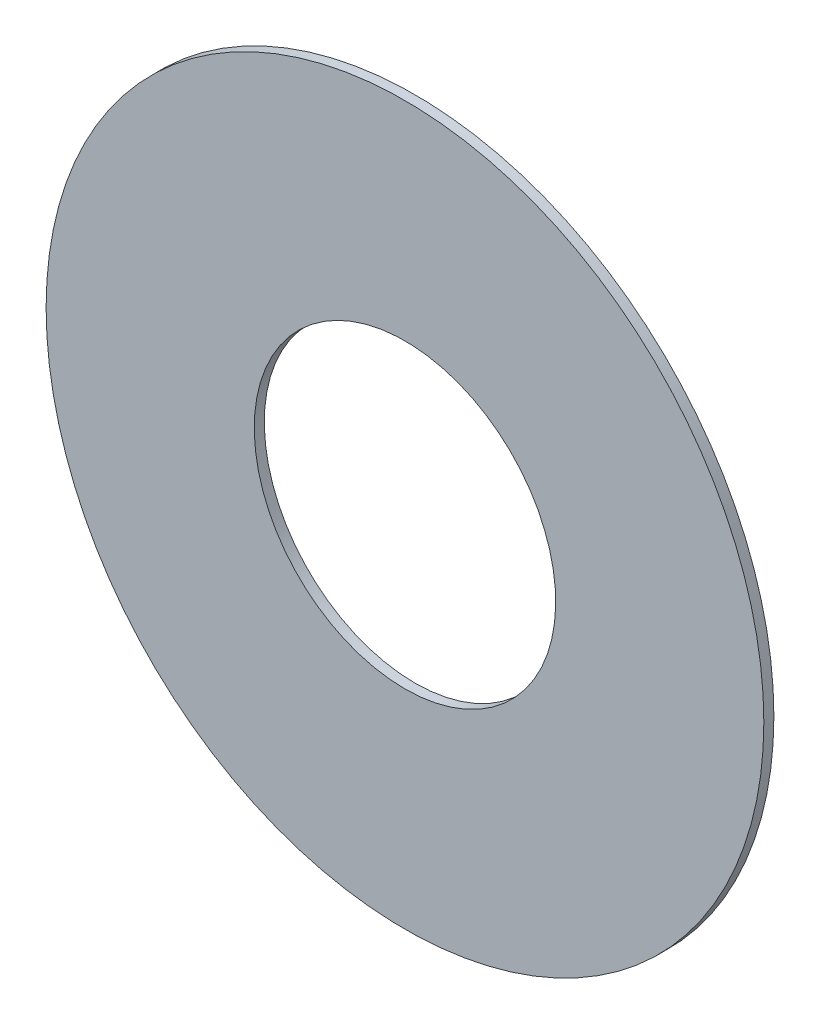
ISO-10303-21;
HEADER;
FILE_DESCRIPTION(('STEP AP214'),'2;1');
FILE_NAME('part.step','',(''),(''),'','','');
FILE_SCHEMA(('AUTOMOTIVE_DESIGN { 1 0 10303 214 1 1 1 1 }'));
ENDSEC;
DATA;
#1=APPLICATION_CONTEXT('core data for automotive mechanical design processes');
#2=APPLICATION_PROTOCOL_DEFINITION('international standard','automotive_design',2000,#1);
#3=PRODUCT_CONTEXT('',#1,'mechanical');
#4=PRODUCT('Part','Part','',(#3));
#5=PRODUCT_RELATED_PRODUCT_CATEGORY('part','',(#4));
#6=PRODUCT_DEFINITION_FORMATION('','',#4);
#7=PRODUCT_DEFINITION_CONTEXT('part definition',#1,'design');
#8=PRODUCT_DEFINITION('design','',#6,#7);
#9=PRODUCT_DEFINITION_SHAPE('','',#8);
#10=(LENGTH_UNIT() NAMED_UNIT(*) SI_UNIT(.MILLI.,.METRE.));
#11=(NAMED_UNIT(*) PLANE_ANGLE_UNIT() SI_UNIT($,.RADIAN.));
#12=(NAMED_UNIT(*) SI_UNIT($,.STERADIAN.) SOLID_ANGLE_UNIT());
#13=UNCERTAINTY_MEASURE_WITH_UNIT(LENGTH_MEASURE(1.E-05),#10,'distance_accuracy_value','');
#14=(GEOMETRIC_REPRESENTATION_CONTEXT(3) GLOBAL_UNCERTAINTY_ASSIGNED_CONTEXT((#13)) GLOBAL_UNIT_ASSIGNED_CONTEXT((#10,
#11,#12)) REPRESENTATION_CONTEXT('',''));
#15=CARTESIAN_POINT('',(0.,0.,0.));
#16=DIRECTION('',(0.,0.,1.));
#17=DIRECTION('',(1.,0.,0.));
#18=AXIS2_PLACEMENT_3D('',#15,#16,#17);
#19=CARTESIAN_POINT('',(144.202,-113.984,-0.045));
#20=DIRECTION('',(0.,0.,-1.));
#21=DIRECTION('',(0.,-1.,0.));
#22=AXIS2_PLACEMENT_3D('',#19,#20,#21);
#23=CYLINDRICAL_SURFACE('',#22,0.525);
#24=CARTESIAN_POINT('',(144.202,-113.984,-0.035));
#25=DIRECTION('',(0.,0.,-1.));
#26=DIRECTION('',(0.,-1.,0.));
#27=AXIS2_PLACEMENT_3D('',#24,#25,#26);
#28=CIRCLE('',#27,0.525);
#29=CARTESIAN_POINT('',(144.202,-114.509,-0.035));
#30=VERTEX_POINT('',#29);
#31=EDGE_CURVE('E20',#30,#30,#28,.T.);
#32=ORIENTED_EDGE('',*,*,#31,.T.);
#33=DIRECTION('',(0.,0.,1.));
#34=VECTOR('',#33,1.);
#35=CARTESIAN_POINT('',(144.202,-114.509,-0.045));
#36=LINE('',#35,#34);
#37=CARTESIAN_POINT('',(144.202,-114.509,0.));
#38=VERTEX_POINT('',#37);
#39=EDGE_CURVE('E11',#30,#38,#36,.T.);
#40=ORIENTED_EDGE('',*,*,#39,.T.);
#41=CARTESIAN_POINT('',(144.202,-113.984,0.));
#42=DIRECTION('',(0.,0.,-1.));
#43=DIRECTION('',(0.,-1.,0.));
#44=AXIS2_PLACEMENT_3D('',#41,#42,#43);
#45=CIRCLE('',#44,0.525);
#46=EDGE_CURVE('E66',#38,#38,#45,.T.);
#47=ORIENTED_EDGE('',*,*,#46,.F.);
#48=ORIENTED_EDGE('',*,*,#39,.F.);
#49=EDGE_LOOP('',(#32,#40,#47,#48));
#50=FACE_BOUND('',#49,.T.);
#51=ADVANCED_FACE('F17',(#50),#23,.F.);
#52=CARTESIAN_POINT('',(144.202,-113.984,-0.035));
#53=DIRECTION('',(0.,0.,1.));
#54=DIRECTION('',(1.,0.,0.));
#55=AXIS2_PLACEMENT_3D('',#52,#53,#54);
#56=PLANE('',#55);
#57=ORIENTED_EDGE('',*,*,#31,.F.);
#58=EDGE_LOOP('',(#57));
#59=FACE_BOUND('',#58,.T.);
#60=CARTESIAN_POINT('',(144.202,-113.984,-0.035));
#61=DIRECTION('',(0.,0.,1.));
#62=DIRECTION('',(1.,0.,0.));
#63=AXIS2_PLACEMENT_3D('',#60,#61,#62);
#64=CIRCLE('',#63,1.25);
#65=CARTESIAN_POINT('',(145.452,-113.984,-0.035));
#66=VERTEX_POINT('',#65);
#67=EDGE_CURVE('E54',#66,#66,#64,.T.);
#68=ORIENTED_EDGE('',*,*,#67,.F.);
#69=EDGE_LOOP('',(#68));
#70=FACE_BOUND('',#69,.T.);
#71=ADVANCED_FACE('F77',(#59,#70),#56,.F.);
#72=CARTESIAN_POINT('',(144.202,-113.984,0.));
#73=DIRECTION('',(0.,0.,1.));
#74=DIRECTION('',(1.,0.,0.));
#75=AXIS2_PLACEMENT_3D('',#72,#73,#74);
#76=PLANE('',#75);
#77=ORIENTED_EDGE('',*,*,#46,.T.);
#78=EDGE_LOOP('',(#77));
#79=FACE_BOUND('',#78,.T.);
#80=CARTESIAN_POINT('',(144.202,-113.984,0.));
#81=DIRECTION('',(0.,0.,1.));
#82=DIRECTION('',(1.,0.,0.));
#83=AXIS2_PLACEMENT_3D('',#80,#81,#82);
#84=CIRCLE('',#83,1.25);
#85=CARTESIAN_POINT('',(145.452,-113.984,0.));
#86=VERTEX_POINT('',#85);
#87=EDGE_CURVE('E52',#86,#86,#84,.T.);
#88=ORIENTED_EDGE('',*,*,#87,.T.);
#89=EDGE_LOOP('',(#88));
#90=FACE_BOUND('',#89,.T.);
#91=ADVANCED_FACE('F58',(#79,#90),#76,.T.);
#92=CARTESIAN_POINT('',(144.202,-113.984,-0.035));
#93=DIRECTION('',(0.,0.,1.));
#94=DIRECTION('',(1.,0.,0.));
#95=AXIS2_PLACEMENT_3D('',#92,#93,#94);
#96=CYLINDRICAL_SURFACE('',#95,1.25);
#97=ORIENTED_EDGE('',*,*,#87,.F.);
#98=DIRECTION('',(0.,0.,1.));
#99=VECTOR('',#98,1.);
#100=CARTESIAN_POINT('',(145.452,-113.984,-0.035));
#101=LINE('',#100,#99);
#102=EDGE_CURVE('E49',#66,#86,#101,.T.);
#103=ORIENTED_EDGE('',*,*,#102,.F.);
#104=ORIENTED_EDGE('',*,*,#67,.T.);
#105=ORIENTED_EDGE('',*,*,#102,.T.);
#106=EDGE_LOOP('',(#97,#103,#104,#105));
#107=FACE_BOUND('',#106,.T.);
#108=ADVANCED_FACE('F51',(#107),#96,.T.);
#109=CLOSED_SHELL('',(#51,#71,#91,#108));
#110=MANIFOLD_SOLID_BREP('B1',#109);
#111=ADVANCED_BREP_SHAPE_REPRESENTATION('',(#18,#110),#14);
#112=SHAPE_DEFINITION_REPRESENTATION(#9,#111);
ENDSEC;
END-ISO-10303-21;
